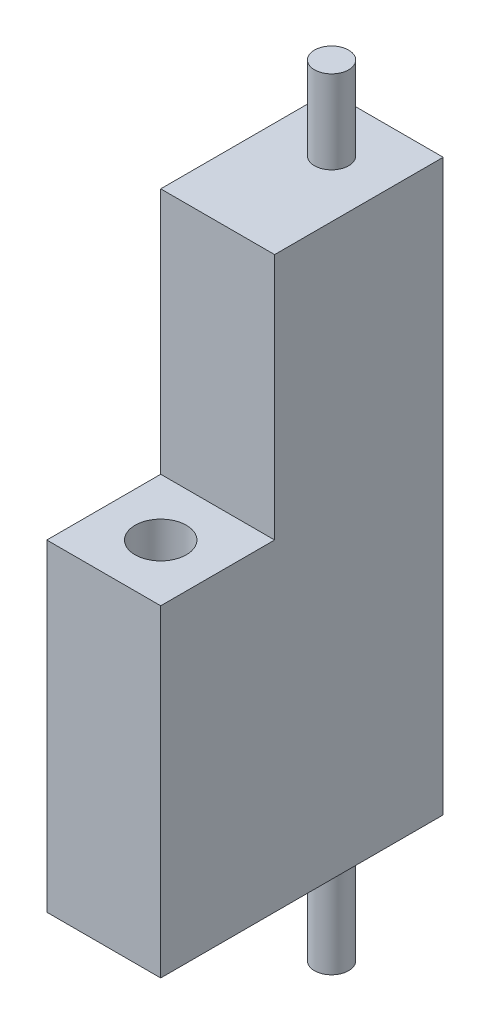
ISO-10303-21;
HEADER;
FILE_DESCRIPTION(('STEP AP214'),'2;1');
FILE_NAME('part.step','',(''),(''),'','','');
FILE_SCHEMA(('AUTOMOTIVE_DESIGN { 1 0 10303 214 1 1 1 1 }'));
ENDSEC;
DATA;
#1=APPLICATION_CONTEXT('core data for automotive mechanical design processes');
#2=APPLICATION_PROTOCOL_DEFINITION('international standard','automotive_design',2000,#1);
#3=PRODUCT_CONTEXT('',#1,'mechanical');
#4=PRODUCT('Part','Part','',(#3));
#5=PRODUCT_RELATED_PRODUCT_CATEGORY('part','',(#4));
#6=PRODUCT_DEFINITION_FORMATION('','',#4);
#7=PRODUCT_DEFINITION_CONTEXT('part definition',#1,'design');
#8=PRODUCT_DEFINITION('design','',#6,#7);
#9=PRODUCT_DEFINITION_SHAPE('','',#8);
#10=(LENGTH_UNIT() NAMED_UNIT(*) SI_UNIT(.MILLI.,.METRE.));
#11=(NAMED_UNIT(*) PLANE_ANGLE_UNIT() SI_UNIT($,.RADIAN.));
#12=(NAMED_UNIT(*) SI_UNIT($,.STERADIAN.) SOLID_ANGLE_UNIT());
#13=UNCERTAINTY_MEASURE_WITH_UNIT(LENGTH_MEASURE(1.E-05),#10,'distance_accuracy_value','');
#14=(GEOMETRIC_REPRESENTATION_CONTEXT(3) GLOBAL_UNCERTAINTY_ASSIGNED_CONTEXT((#13)) GLOBAL_UNIT_ASSIGNED_CONTEXT((#10,
#11,#12)) REPRESENTATION_CONTEXT('',''));
#15=CARTESIAN_POINT('',(0.,0.,0.));
#16=DIRECTION('',(0.,0.,1.));
#17=DIRECTION('',(1.,0.,0.));
#18=AXIS2_PLACEMENT_3D('',#15,#16,#17);
#19=CARTESIAN_POINT('',(0.,-33.,-50.));
#20=DIRECTION('',(0.,-1.,0.));
#21=DIRECTION('',(0.,0.,-1.));
#22=AXIS2_PLACEMENT_3D('',#19,#20,#21);
#23=PLANE('',#22);
#24=CARTESIAN_POINT('',(22.5,-33.,0.));
#25=DIRECTION('',(0.,-1.,0.));
#26=DIRECTION('',(0.,0.,-1.));
#27=AXIS2_PLACEMENT_3D('',#24,#25,#26);
#28=CIRCLE('',#27,20.32);
#29=CARTESIAN_POINT('',(22.5,-33.,-20.32));
#30=VERTEX_POINT('',#29);
#31=EDGE_CURVE('E309',#30,#30,#28,.T.);
#32=ORIENTED_EDGE('',*,*,#31,.F.);
#33=EDGE_LOOP('',(#32));
#34=FACE_BOUND('',#33,.T.);
#35=DIRECTION('',(0.,0.,1.));
#36=VECTOR('',#35,1.);
#37=CARTESIAN_POINT('',(72.5,-33.,-50.));
#38=LINE('',#37,#36);
#39=CARTESIAN_POINT('',(72.5,-33.,-198.));
#40=VERTEX_POINT('',#39);
#41=CARTESIAN_POINT('',(72.5,-33.,49.9999999999999));
#42=VERTEX_POINT('',#41);
#43=EDGE_CURVE('E413',#40,#42,#38,.T.);
#44=ORIENTED_EDGE('',*,*,#43,.T.);
#45=DIRECTION('',(1.,0.,0.));
#46=VECTOR('',#45,1.);
#47=CARTESIAN_POINT('',(0.,-33.,49.9999999999999));
#48=LINE('',#47,#46);
#49=CARTESIAN_POINT('',(-27.5,-33.,49.9999999999999));
#50=VERTEX_POINT('',#49);
#51=EDGE_CURVE('E408',#50,#42,#48,.T.);
#52=ORIENTED_EDGE('',*,*,#51,.F.);
#53=DIRECTION('',(0.,0.,1.));
#54=VECTOR('',#53,1.);
#55=CARTESIAN_POINT('',(-27.5,-33.,-50.));
#56=LINE('',#55,#54);
#57=CARTESIAN_POINT('',(-27.5,-33.,-198.));
#58=VERTEX_POINT('',#57);
#59=EDGE_CURVE('E412',#58,#50,#56,.T.);
#60=ORIENTED_EDGE('',*,*,#59,.F.);
#61=DIRECTION('',(-1.,0.,0.));
#62=VECTOR('',#61,1.);
#63=CARTESIAN_POINT('',(72.5,-33.,-198.));
#64=LINE('',#63,#62);
#65=EDGE_CURVE('E381',#40,#58,#64,.T.);
#66=ORIENTED_EDGE('',*,*,#65,.F.);
#67=EDGE_LOOP('',(#44,#52,#60,#66));
#68=FACE_BOUND('',#67,.T.);
#69=CARTESIAN_POINT('',(22.5,-33.,-150.));
#70=DIRECTION('',(0.,-1.,0.));
#71=DIRECTION('',(0.,0.,-1.));
#72=AXIS2_PLACEMENT_3D('',#69,#70,#71);
#73=CIRCLE('',#72,15.);
#74=CARTESIAN_POINT('',(22.5,-33.,-165.));
#75=VERTEX_POINT('',#74);
#76=EDGE_CURVE('E317',#75,#75,#73,.F.);
#77=ORIENTED_EDGE('',*,*,#76,.T.);
#78=EDGE_LOOP('',(#77));
#79=FACE_BOUND('',#78,.T.);
#80=ADVANCED_FACE('F79',(#34,#68,#79),#23,.T.);
#81=CARTESIAN_POINT('',(0.,10.,0.));
#82=DIRECTION('',(0.,-1.,0.));
#83=DIRECTION('',(0.,0.,-1.));
#84=AXIS2_PLACEMENT_3D('',#81,#82,#83);
#85=PLANE('',#84);
#86=CARTESIAN_POINT('',(22.5,10.,0.));
#87=DIRECTION('',(0.,1.,0.));
#88=DIRECTION('',(0.,0.,1.));
#89=AXIS2_PLACEMENT_3D('',#86,#87,#88);
#90=CIRCLE('',#89,14.);
#91=CARTESIAN_POINT('',(22.5,10.,14.));
#92=VERTEX_POINT('',#91);
#93=EDGE_CURVE('E245',#92,#92,#90,.T.);
#94=ORIENTED_EDGE('',*,*,#93,.F.);
#95=EDGE_LOOP('',(#94));
#96=FACE_BOUND('',#95,.T.);
#97=CARTESIAN_POINT('',(40.0000000000002,10.,1.80411241501588E-13));
#98=DIRECTION('',(0.,-1.,0.));
#99=DIRECTION('',(0.,0.,-1.));
#100=AXIS2_PLACEMENT_3D('',#97,#98,#99);
#101=CIRCLE('',#100,2.);
#102=CARTESIAN_POINT('',(40.0000000000002,10.,-1.99999999999982));
#103=VERTEX_POINT('',#102);
#104=EDGE_CURVE('E278',#103,#103,#101,.T.);
#105=ORIENTED_EDGE('',*,*,#104,.T.);
#106=EDGE_LOOP('',(#105));
#107=FACE_BOUND('',#106,.T.);
#108=CARTESIAN_POINT('',(34.8743686707647,10.,12.3743686707647));
#109=DIRECTION('',(0.,-1.,0.));
#110=DIRECTION('',(0.,0.,-1.));
#111=AXIS2_PLACEMENT_3D('',#108,#109,#110);
#112=CIRCLE('',#111,2.);
#113=CARTESIAN_POINT('',(34.8743686707647,10.,10.3743686707647));
#114=VERTEX_POINT('',#113);
#115=EDGE_CURVE('E286',#114,#114,#112,.T.);
#116=ORIENTED_EDGE('',*,*,#115,.T.);
#117=EDGE_LOOP('',(#116));
#118=FACE_BOUND('',#117,.T.);
#119=CARTESIAN_POINT('',(22.5,10.,17.5));
#120=DIRECTION('',(0.,-1.,0.));
#121=DIRECTION('',(0.,0.,-1.));
#122=AXIS2_PLACEMENT_3D('',#119,#120,#121);
#123=CIRCLE('',#122,2.);
#124=CARTESIAN_POINT('',(22.5,10.,15.5));
#125=VERTEX_POINT('',#124);
#126=EDGE_CURVE('E294',#125,#125,#123,.T.);
#127=ORIENTED_EDGE('',*,*,#126,.T.);
#128=EDGE_LOOP('',(#127));
#129=FACE_BOUND('',#128,.T.);
#130=CARTESIAN_POINT('',(10.1256313292356,10.,12.3743686707646));
#131=DIRECTION('',(0.,-1.,0.));
#132=DIRECTION('',(0.,0.,-1.));
#133=AXIS2_PLACEMENT_3D('',#130,#131,#132);
#134=CIRCLE('',#133,2.);
#135=CARTESIAN_POINT('',(10.1256313292356,10.,10.3743686707646));
#136=VERTEX_POINT('',#135);
#137=EDGE_CURVE('E253',#136,#136,#134,.T.);
#138=ORIENTED_EDGE('',*,*,#137,.T.);
#139=EDGE_LOOP('',(#138));
#140=FACE_BOUND('',#139,.T.);
#141=CARTESIAN_POINT('',(5.00000000000024,10.,0.));
#142=DIRECTION('',(0.,-1.,0.));
#143=DIRECTION('',(0.,0.,-1.));
#144=AXIS2_PLACEMENT_3D('',#141,#142,#143);
#145=CIRCLE('',#144,2.);
#146=CARTESIAN_POINT('',(5.00000000000024,10.,-2.00000000000006));
#147=VERTEX_POINT('',#146);
#148=EDGE_CURVE('E254',#147,#147,#145,.T.);
#149=ORIENTED_EDGE('',*,*,#148,.T.);
#150=EDGE_LOOP('',(#149));
#151=FACE_BOUND('',#150,.T.);
#152=CARTESIAN_POINT('',(10.1256313292357,10.,-12.3743686707646));
#153=DIRECTION('',(0.,-1.,0.));
#154=DIRECTION('',(0.,0.,-1.));
#155=AXIS2_PLACEMENT_3D('',#152,#153,#154);
#156=CIRCLE('',#155,2.);
#157=CARTESIAN_POINT('',(10.1256313292357,10.,-14.3743686707646));
#158=VERTEX_POINT('',#157);
#159=EDGE_CURVE('E262',#158,#158,#156,.T.);
#160=ORIENTED_EDGE('',*,*,#159,.T.);
#161=EDGE_LOOP('',(#160));
#162=FACE_BOUND('',#161,.T.);
#163=CARTESIAN_POINT('',(22.5000000000003,10.,-17.4999999999995));
#164=DIRECTION('',(0.,-1.,0.));
#165=DIRECTION('',(0.,0.,-1.));
#166=AXIS2_PLACEMENT_3D('',#163,#164,#165);
#167=CIRCLE('',#166,2.00000000000007);
#168=CARTESIAN_POINT('',(22.5000000000003,10.,-19.4999999999995));
#169=VERTEX_POINT('',#168);
#170=EDGE_CURVE('E244',#169,#169,#167,.T.);
#171=ORIENTED_EDGE('',*,*,#170,.T.);
#172=EDGE_LOOP('',(#171));
#173=FACE_BOUND('',#172,.T.);
#174=CARTESIAN_POINT('',(34.8743686707646,10.,-12.374368670764));
#175=DIRECTION('',(0.,-1.,0.));
#176=DIRECTION('',(0.,0.,-1.));
#177=AXIS2_PLACEMENT_3D('',#174,#175,#176);
#178=CIRCLE('',#177,2.00000000000026);
#179=CARTESIAN_POINT('',(34.8743686707646,10.,-14.3743686707643));
#180=VERTEX_POINT('',#179);
#181=EDGE_CURVE('E305',#180,#180,#178,.T.);
#182=ORIENTED_EDGE('',*,*,#181,.T.);
#183=EDGE_LOOP('',(#182));
#184=FACE_BOUND('',#183,.T.);
#185=CARTESIAN_POINT('',(22.5,10.,0.));
#186=DIRECTION('',(0.,-1.,0.));
#187=DIRECTION('',(0.,0.,-1.));
#188=AXIS2_PLACEMENT_3D('',#185,#186,#187);
#189=CIRCLE('',#188,21.5);
#190=CARTESIAN_POINT('',(22.5,10.,-21.5));
#191=VERTEX_POINT('',#190);
#192=EDGE_CURVE('E443',#191,#191,#189,.T.);
#193=ORIENTED_EDGE('',*,*,#192,.F.);
#194=EDGE_LOOP('',(#193));
#195=FACE_BOUND('',#194,.T.);
#196=ADVANCED_FACE('F504',(#96,#107,#118,#129,#140,#151,#162,#173,#184,#195),#85,.F.);
#197=CARTESIAN_POINT('',(22.5,0.,0.));
#198=DIRECTION('',(0.,-1.,0.));
#199=DIRECTION('',(0.,0.,-1.));
#200=AXIS2_PLACEMENT_3D('',#197,#198,#199);
#201=CYLINDRICAL_SURFACE('',#200,21.5);
#202=ORIENTED_EDGE('',*,*,#192,.T.);
#203=EDGE_LOOP('',(#202));
#204=FACE_BOUND('',#203,.T.);
#205=CARTESIAN_POINT('',(22.5,102.,0.));
#206=DIRECTION('',(0.,-1.,0.));
#207=DIRECTION('',(0.,0.,-1.));
#208=AXIS2_PLACEMENT_3D('',#205,#206,#207);
#209=CIRCLE('',#208,21.5);
#210=CARTESIAN_POINT('',(22.5,102.,-21.5));
#211=VERTEX_POINT('',#210);
#212=EDGE_CURVE('E447',#211,#211,#209,.T.);
#213=ORIENTED_EDGE('',*,*,#212,.F.);
#214=EDGE_LOOP('',(#213));
#215=FACE_BOUND('',#214,.T.);
#216=ADVANCED_FACE('F510',(#204,#215),#201,.F.);
#217=CARTESIAN_POINT('',(-1.41553435639707E-12,102.,0.));
#218=DIRECTION('',(0.,-1.,0.));
#219=DIRECTION('',(0.,0.,-1.));
#220=AXIS2_PLACEMENT_3D('',#217,#218,#219);
#221=PLANE('',#220);
#222=CARTESIAN_POINT('',(22.5,102.,0.));
#223=DIRECTION('',(0.,-1.,0.));
#224=DIRECTION('',(0.,0.,-1.));
#225=AXIS2_PLACEMENT_3D('',#222,#223,#224);
#226=CIRCLE('',#225,22.5);
#227=CARTESIAN_POINT('',(22.5,102.,-22.5));
#228=VERTEX_POINT('',#227);
#229=EDGE_CURVE('E451',#228,#228,#226,.T.);
#230=ORIENTED_EDGE('',*,*,#229,.F.);
#231=EDGE_LOOP('',(#230));
#232=FACE_BOUND('',#231,.T.);
#233=ORIENTED_EDGE('',*,*,#212,.T.);
#234=EDGE_LOOP('',(#233));
#235=FACE_BOUND('',#234,.T.);
#236=ADVANCED_FACE('F523',(#232,#235),#221,.F.);
#237=CARTESIAN_POINT('',(22.5,0.,0.));
#238=DIRECTION('',(0.,-1.,0.));
#239=DIRECTION('',(0.,0.,-1.));
#240=AXIS2_PLACEMENT_3D('',#237,#238,#239);
#241=CYLINDRICAL_SURFACE('',#240,22.5);
#242=CARTESIAN_POINT('',(22.5,250.,0.));
#243=DIRECTION('',(0.,-1.,0.));
#244=DIRECTION('',(0.,0.,-1.));
#245=AXIS2_PLACEMENT_3D('',#242,#243,#244);
#246=CIRCLE('',#245,22.5);
#247=CARTESIAN_POINT('',(22.5,250.,-22.5));
#248=VERTEX_POINT('',#247);
#249=EDGE_CURVE('E455',#248,#248,#246,.T.);
#250=ORIENTED_EDGE('',*,*,#249,.F.);
#251=EDGE_LOOP('',(#250));
#252=FACE_BOUND('',#251,.T.);
#253=ORIENTED_EDGE('',*,*,#229,.T.);
#254=EDGE_LOOP('',(#253));
#255=FACE_BOUND('',#254,.T.);
#256=ADVANCED_FACE('F526',(#252,#255),#241,.F.);
#257=CARTESIAN_POINT('',(6.93889390390723E-13,250.,0.));
#258=DIRECTION('',(0.,-1.,0.));
#259=DIRECTION('',(0.,0.,-1.));
#260=AXIS2_PLACEMENT_3D('',#257,#258,#259);
#261=PLANE('',#260);
#262=ORIENTED_EDGE('',*,*,#249,.T.);
#263=EDGE_LOOP('',(#262));
#264=FACE_BOUND('',#263,.T.);
#265=DIRECTION('',(0.,0.,1.));
#266=VECTOR('',#265,1.);
#267=CARTESIAN_POINT('',(72.5,250.,0.));
#268=LINE('',#267,#266);
#269=CARTESIAN_POINT('',(72.5,250.,-50.));
#270=VERTEX_POINT('',#269);
#271=CARTESIAN_POINT('',(72.5,250.,50.));
#272=VERTEX_POINT('',#271);
#273=EDGE_CURVE('E436',#270,#272,#268,.T.);
#274=ORIENTED_EDGE('',*,*,#273,.F.);
#275=DIRECTION('',(1.,0.,0.));
#276=VECTOR('',#275,1.);
#277=CARTESIAN_POINT('',(0.,250.,-50.));
#278=LINE('',#277,#276);
#279=CARTESIAN_POINT('',(-27.5,250.,-50.));
#280=VERTEX_POINT('',#279);
#281=EDGE_CURVE('E417',#280,#270,#278,.T.);
#282=ORIENTED_EDGE('',*,*,#281,.F.);
#283=DIRECTION('',(0.,0.,1.));
#284=VECTOR('',#283,1.);
#285=CARTESIAN_POINT('',(-27.5,250.,0.));
#286=LINE('',#285,#284);
#287=CARTESIAN_POINT('',(-27.5,250.,50.));
#288=VERTEX_POINT('',#287);
#289=EDGE_CURVE('E428',#280,#288,#286,.T.);
#290=ORIENTED_EDGE('',*,*,#289,.T.);
#291=DIRECTION('',(1.,0.,0.));
#292=VECTOR('',#291,1.);
#293=CARTESIAN_POINT('',(0.,250.,50.));
#294=LINE('',#293,#292);
#295=EDGE_CURVE('E432',#288,#272,#294,.T.);
#296=ORIENTED_EDGE('',*,*,#295,.T.);
#297=EDGE_LOOP('',(#274,#282,#290,#296));
#298=FACE_BOUND('',#297,.T.);
#299=ADVANCED_FACE('F81',(#264,#298),#261,.F.);
#300=CARTESIAN_POINT('',(72.5,0.,0.));
#301=DIRECTION('',(-1.,0.,0.));
#302=DIRECTION('',(0.,0.,1.));
#303=AXIS2_PLACEMENT_3D('',#300,#301,#302);
#304=PLANE('',#303);
#305=ORIENTED_EDGE('',*,*,#273,.T.);
#306=DIRECTION('',(0.,1.,0.));
#307=VECTOR('',#306,1.);
#308=CARTESIAN_POINT('',(72.5,0.,50.));
#309=LINE('',#308,#307);
#310=EDGE_CURVE('E440',#42,#272,#309,.T.);
#311=ORIENTED_EDGE('',*,*,#310,.F.);
#312=ORIENTED_EDGE('',*,*,#43,.F.);
#313=DIRECTION('',(0.,-1.,0.));
#314=VECTOR('',#313,1.);
#315=CARTESIAN_POINT('',(72.5,467.,-198.));
#316=LINE('',#315,#314);
#317=CARTESIAN_POINT('',(72.5,467.,-198.));
#318=VERTEX_POINT('',#317);
#319=EDGE_CURVE('E377',#318,#40,#316,.T.);
#320=ORIENTED_EDGE('',*,*,#319,.F.);
#321=DIRECTION('',(0.,0.,1.));
#322=VECTOR('',#321,1.);
#323=CARTESIAN_POINT('',(72.5,467.,-198.));
#324=LINE('',#323,#322);
#325=CARTESIAN_POINT('',(72.5,467.,-50.));
#326=VERTEX_POINT('',#325);
#327=EDGE_CURVE('E392',#318,#326,#324,.T.);
#328=ORIENTED_EDGE('',*,*,#327,.T.);
#329=DIRECTION('',(0.,-1.,0.));
#330=VECTOR('',#329,1.);
#331=CARTESIAN_POINT('',(72.5,467.,-50.));
#332=LINE('',#331,#330);
#333=EDGE_CURVE('E376',#326,#270,#332,.T.);
#334=ORIENTED_EDGE('',*,*,#333,.T.);
#335=EDGE_LOOP('',(#305,#311,#312,#320,#328,#334));
#336=FACE_BOUND('',#335,.T.);
#337=ADVANCED_FACE('F480',(#336),#304,.F.);
#338=CARTESIAN_POINT('',(0.,0.,50.));
#339=DIRECTION('',(0.,0.,1.));
#340=DIRECTION('',(1.,0.,0.));
#341=AXIS2_PLACEMENT_3D('',#338,#339,#340);
#342=PLANE('',#341);
#343=ORIENTED_EDGE('',*,*,#295,.F.);
#344=DIRECTION('',(0.,1.,0.));
#345=VECTOR('',#344,1.);
#346=CARTESIAN_POINT('',(-27.5,0.,50.));
#347=LINE('',#346,#345);
#348=EDGE_CURVE('E424',#50,#288,#347,.T.);
#349=ORIENTED_EDGE('',*,*,#348,.F.);
#350=ORIENTED_EDGE('',*,*,#51,.T.);
#351=ORIENTED_EDGE('',*,*,#310,.T.);
#352=EDGE_LOOP('',(#343,#349,#350,#351));
#353=FACE_BOUND('',#352,.T.);
#354=ADVANCED_FACE('F488',(#353),#342,.T.);
#355=CARTESIAN_POINT('',(-27.5,0.,0.));
#356=DIRECTION('',(-1.,0.,0.));
#357=DIRECTION('',(0.,0.,1.));
#358=AXIS2_PLACEMENT_3D('',#355,#356,#357);
#359=PLANE('',#358);
#360=ORIENTED_EDGE('',*,*,#289,.F.);
#361=DIRECTION('',(0.,1.,0.));
#362=VECTOR('',#361,1.);
#363=CARTESIAN_POINT('',(-27.5,467.,-50.));
#364=LINE('',#363,#362);
#365=CARTESIAN_POINT('',(-27.5,467.,-50.));
#366=VERTEX_POINT('',#365);
#367=EDGE_CURVE('E396',#280,#366,#364,.T.);
#368=ORIENTED_EDGE('',*,*,#367,.T.);
#369=DIRECTION('',(0.,0.,1.));
#370=VECTOR('',#369,1.);
#371=CARTESIAN_POINT('',(-27.5,467.,-198.));
#372=LINE('',#371,#370);
#373=CARTESIAN_POINT('',(-27.5,467.,-198.));
#374=VERTEX_POINT('',#373);
#375=EDGE_CURVE('E404',#374,#366,#372,.T.);
#376=ORIENTED_EDGE('',*,*,#375,.F.);
#377=DIRECTION('',(0.,1.,0.));
#378=VECTOR('',#377,1.);
#379=CARTESIAN_POINT('',(-27.5,467.,-198.));
#380=LINE('',#379,#378);
#381=EDGE_CURVE('E386',#58,#374,#380,.T.);
#382=ORIENTED_EDGE('',*,*,#381,.F.);
#383=ORIENTED_EDGE('',*,*,#59,.T.);
#384=ORIENTED_EDGE('',*,*,#348,.T.);
#385=EDGE_LOOP('',(#360,#368,#376,#382,#383,#384));
#386=FACE_BOUND('',#385,.T.);
#387=ADVANCED_FACE('F491',(#386),#359,.T.);
#388=CARTESIAN_POINT('',(0.,0.,-50.));
#389=DIRECTION('',(0.,0.,-1.));
#390=DIRECTION('',(-1.,0.,0.));
#391=AXIS2_PLACEMENT_3D('',#388,#389,#390);
#392=PLANE('',#391);
#393=ORIENTED_EDGE('',*,*,#367,.F.);
#394=ORIENTED_EDGE('',*,*,#281,.T.);
#395=ORIENTED_EDGE('',*,*,#333,.F.);
#396=DIRECTION('',(1.,0.,0.));
#397=VECTOR('',#396,1.);
#398=CARTESIAN_POINT('',(72.5,467.,-50.));
#399=LINE('',#398,#397);
#400=EDGE_CURVE('E382',#366,#326,#399,.T.);
#401=ORIENTED_EDGE('',*,*,#400,.F.);
#402=EDGE_LOOP('',(#393,#394,#395,#401));
#403=FACE_BOUND('',#402,.T.);
#404=ADVANCED_FACE('F469',(#403),#392,.F.);
#405=CARTESIAN_POINT('',(72.5,467.,-198.));
#406=DIRECTION('',(0.,-1.,0.));
#407=DIRECTION('',(0.,0.,-1.));
#408=AXIS2_PLACEMENT_3D('',#405,#406,#407);
#409=PLANE('',#408);
#410=CARTESIAN_POINT('',(22.5,467.,-150.));
#411=DIRECTION('',(0.,-1.,0.));
#412=DIRECTION('',(0.,0.,-1.));
#413=AXIS2_PLACEMENT_3D('',#410,#411,#412);
#414=CIRCLE('',#413,15.);
#415=CARTESIAN_POINT('',(22.5,467.,-165.));
#416=VERTEX_POINT('',#415);
#417=EDGE_CURVE('E90',#416,#416,#414,.F.);
#418=ORIENTED_EDGE('',*,*,#417,.F.);
#419=EDGE_LOOP('',(#418));
#420=FACE_BOUND('',#419,.T.);
#421=ORIENTED_EDGE('',*,*,#400,.T.);
#422=ORIENTED_EDGE('',*,*,#327,.F.);
#423=DIRECTION('',(1.,0.,0.));
#424=VECTOR('',#423,1.);
#425=CARTESIAN_POINT('',(72.5,467.,-198.));
#426=LINE('',#425,#424);
#427=EDGE_CURVE('E389',#374,#318,#426,.T.);
#428=ORIENTED_EDGE('',*,*,#427,.F.);
#429=ORIENTED_EDGE('',*,*,#375,.T.);
#430=EDGE_LOOP('',(#421,#422,#428,#429));
#431=FACE_BOUND('',#430,.T.);
#432=ADVANCED_FACE('F465',(#420,#431),#409,.F.);
#433=CARTESIAN_POINT('',(0.,0.,-198.));
#434=DIRECTION('',(0.,0.,-1.));
#435=DIRECTION('',(-1.,0.,0.));
#436=AXIS2_PLACEMENT_3D('',#433,#434,#435);
#437=PLANE('',#436);
#438=ORIENTED_EDGE('',*,*,#319,.T.);
#439=ORIENTED_EDGE('',*,*,#65,.T.);
#440=ORIENTED_EDGE('',*,*,#381,.T.);
#441=ORIENTED_EDGE('',*,*,#427,.T.);
#442=EDGE_LOOP('',(#438,#439,#440,#441));
#443=FACE_BOUND('',#442,.T.);
#444=ADVANCED_FACE('F468',(#443),#437,.T.);
#445=CARTESIAN_POINT('',(0.,540.,0.));
#446=DIRECTION('',(0.,1.,0.));
#447=DIRECTION('',(0.,0.,1.));
#448=AXIS2_PLACEMENT_3D('',#445,#446,#447);
#449=PLANE('',#448);
#450=CARTESIAN_POINT('',(22.5,540.,-150.));
#451=DIRECTION('',(0.,1.,0.));
#452=DIRECTION('',(0.,0.,1.));
#453=AXIS2_PLACEMENT_3D('',#450,#451,#452);
#454=CIRCLE('',#453,15.);
#455=CARTESIAN_POINT('',(22.5,540.,-135.));
#456=VERTEX_POINT('',#455);
#457=EDGE_CURVE('E372',#456,#456,#454,.T.);
#458=ORIENTED_EDGE('',*,*,#457,.T.);
#459=EDGE_LOOP('',(#458));
#460=FACE_BOUND('',#459,.T.);
#461=ADVANCED_FACE('F494',(#460),#449,.T.);
#462=CARTESIAN_POINT('',(22.5,540.,-150.));
#463=DIRECTION('',(0.,-1.,0.));
#464=DIRECTION('',(0.,0.,-1.));
#465=AXIS2_PLACEMENT_3D('',#462,#463,#464);
#466=CYLINDRICAL_SURFACE('',#465,15.);
#467=ORIENTED_EDGE('',*,*,#457,.F.);
#468=EDGE_LOOP('',(#467));
#469=FACE_BOUND('',#468,.T.);
#470=ORIENTED_EDGE('',*,*,#417,.T.);
#471=EDGE_LOOP('',(#470));
#472=FACE_BOUND('',#471,.T.);
#473=ADVANCED_FACE('F463',(#469,#472),#466,.T.);
#474=CARTESIAN_POINT('',(0.,-145.,0.));
#475=DIRECTION('',(0.,1.,0.));
#476=DIRECTION('',(0.,0.,1.));
#477=AXIS2_PLACEMENT_3D('',#474,#475,#476);
#478=PLANE('',#477);
#479=CARTESIAN_POINT('',(22.5,-145.,-150.));
#480=DIRECTION('',(0.,1.,0.));
#481=DIRECTION('',(0.,0.,1.));
#482=AXIS2_PLACEMENT_3D('',#479,#480,#481);
#483=CIRCLE('',#482,15.);
#484=CARTESIAN_POINT('',(22.5,-145.,-135.));
#485=VERTEX_POINT('',#484);
#486=EDGE_CURVE('E359',#485,#485,#483,.T.);
#487=ORIENTED_EDGE('',*,*,#486,.F.);
#488=EDGE_LOOP('',(#487));
#489=FACE_BOUND('',#488,.T.);
#490=ADVANCED_FACE('F586',(#489),#478,.F.);
#491=ORIENTED_EDGE('',*,*,#76,.F.);
#492=EDGE_LOOP('',(#491));
#493=FACE_BOUND('',#492,.T.);
#494=ORIENTED_EDGE('',*,*,#486,.T.);
#495=EDGE_LOOP('',(#494));
#496=FACE_BOUND('',#495,.T.);
#497=ADVANCED_FACE('F588',(#493,#496),#466,.T.);
#498=CARTESIAN_POINT('',(22.5,0.,0.));
#499=DIRECTION('',(0.,-1.,0.));
#500=DIRECTION('',(0.,0.,-1.));
#501=AXIS2_PLACEMENT_3D('',#498,#499,#500);
#502=CYLINDRICAL_SURFACE('',#501,20.32);
#503=CARTESIAN_POINT('',(22.5,0.,0.));
#504=DIRECTION('',(0.,-1.,0.));
#505=DIRECTION('',(0.,0.,-1.));
#506=AXIS2_PLACEMENT_3D('',#503,#504,#505);
#507=CIRCLE('',#506,20.32);
#508=CARTESIAN_POINT('',(22.5,0.,-20.32));
#509=VERTEX_POINT('',#508);
#510=EDGE_CURVE('E313',#509,#509,#507,.T.);
#511=ORIENTED_EDGE('',*,*,#510,.F.);
#512=EDGE_LOOP('',(#511));
#513=FACE_BOUND('',#512,.T.);
#514=ORIENTED_EDGE('',*,*,#31,.T.);
#515=EDGE_LOOP('',(#514));
#516=FACE_BOUND('',#515,.T.);
#517=ADVANCED_FACE('F624',(#513,#516),#502,.F.);
#518=CARTESIAN_POINT('',(22.5,0.,0.));
#519=DIRECTION('',(0.,-1.,0.));
#520=DIRECTION('',(0.,0.,-1.));
#521=AXIS2_PLACEMENT_3D('',#518,#519,#520);
#522=PLANE('',#521);
#523=DIRECTION('',(0.,0.,1.));
#524=VECTOR('',#523,1.);
#525=CARTESIAN_POINT('',(24.5,0.,0.));
#526=LINE('',#525,#524);
#527=CARTESIAN_POINT('',(24.5,0.,-8.));
#528=VERTEX_POINT('',#527);
#529=CARTESIAN_POINT('',(24.5,0.,-5.65685424949238));
#530=VERTEX_POINT('',#529);
#531=EDGE_CURVE('E210',#528,#530,#526,.T.);
#532=ORIENTED_EDGE('',*,*,#531,.F.);
#533=DIRECTION('',(1.,0.,0.));
#534=VECTOR('',#533,1.);
#535=CARTESIAN_POINT('',(0.,0.,-8.));
#536=LINE('',#535,#534);
#537=CARTESIAN_POINT('',(20.5,0.,-8.));
#538=VERTEX_POINT('',#537);
#539=EDGE_CURVE('E213',#538,#528,#536,.T.);
#540=ORIENTED_EDGE('',*,*,#539,.F.);
#541=DIRECTION('',(0.,0.,1.));
#542=VECTOR('',#541,1.);
#543=CARTESIAN_POINT('',(20.5,0.,0.));
#544=LINE('',#543,#542);
#545=CARTESIAN_POINT('',(20.5,0.,-5.65685424949238));
#546=VERTEX_POINT('',#545);
#547=EDGE_CURVE('E187',#538,#546,#544,.T.);
#548=ORIENTED_EDGE('',*,*,#547,.T.);
#549=CARTESIAN_POINT('',(22.5,0.,0.));
#550=DIRECTION('',(0.,-1.,0.));
#551=DIRECTION('',(0.,0.,-1.));
#552=AXIS2_PLACEMENT_3D('',#549,#550,#551);
#553=CIRCLE('',#552,6.);
#554=EDGE_CURVE('E226',#530,#546,#553,.T.);
#555=ORIENTED_EDGE('',*,*,#554,.F.);
#556=EDGE_LOOP('',(#532,#540,#548,#555));
#557=FACE_BOUND('',#556,.T.);
#558=CARTESIAN_POINT('',(40.0000000000002,0.,1.80411241501588E-13));
#559=DIRECTION('',(0.,-1.,0.));
#560=DIRECTION('',(0.,0.,-1.));
#561=AXIS2_PLACEMENT_3D('',#558,#559,#560);
#562=CIRCLE('',#561,2.);
#563=CARTESIAN_POINT('',(40.0000000000002,0.,-1.99999999999982));
#564=VERTEX_POINT('',#563);
#565=EDGE_CURVE('E273',#564,#564,#562,.T.);
#566=ORIENTED_EDGE('',*,*,#565,.F.);
#567=EDGE_LOOP('',(#566));
#568=FACE_BOUND('',#567,.T.);
#569=CARTESIAN_POINT('',(34.8743686707647,0.,12.3743686707647));
#570=DIRECTION('',(0.,-1.,0.));
#571=DIRECTION('',(0.,0.,-1.));
#572=AXIS2_PLACEMENT_3D('',#569,#570,#571);
#573=CIRCLE('',#572,2.);
#574=CARTESIAN_POINT('',(34.8743686707647,0.,10.3743686707647));
#575=VERTEX_POINT('',#574);
#576=EDGE_CURVE('E282',#575,#575,#573,.T.);
#577=ORIENTED_EDGE('',*,*,#576,.F.);
#578=EDGE_LOOP('',(#577));
#579=FACE_BOUND('',#578,.T.);
#580=CARTESIAN_POINT('',(22.5,0.,17.5));
#581=DIRECTION('',(0.,-1.,0.));
#582=DIRECTION('',(0.,0.,-1.));
#583=AXIS2_PLACEMENT_3D('',#580,#581,#582);
#584=CIRCLE('',#583,2.);
#585=CARTESIAN_POINT('',(22.5,0.,15.5));
#586=VERTEX_POINT('',#585);
#587=EDGE_CURVE('E290',#586,#586,#584,.T.);
#588=ORIENTED_EDGE('',*,*,#587,.F.);
#589=EDGE_LOOP('',(#588));
#590=FACE_BOUND('',#589,.T.);
#591=CARTESIAN_POINT('',(10.1256313292356,0.,12.3743686707646));
#592=DIRECTION('',(0.,-1.,0.));
#593=DIRECTION('',(0.,0.,-1.));
#594=AXIS2_PLACEMENT_3D('',#591,#592,#593);
#595=CIRCLE('',#594,2.);
#596=CARTESIAN_POINT('',(10.1256313292356,0.,10.3743686707646));
#597=VERTEX_POINT('',#596);
#598=EDGE_CURVE('E298',#597,#597,#595,.T.);
#599=ORIENTED_EDGE('',*,*,#598,.F.);
#600=EDGE_LOOP('',(#599));
#601=FACE_BOUND('',#600,.T.);
#602=CARTESIAN_POINT('',(5.00000000000024,0.,0.));
#603=DIRECTION('',(0.,-1.,0.));
#604=DIRECTION('',(0.,0.,-1.));
#605=AXIS2_PLACEMENT_3D('',#602,#603,#604);
#606=CIRCLE('',#605,2.);
#607=CARTESIAN_POINT('',(5.00000000000024,0.,-2.00000000000006));
#608=VERTEX_POINT('',#607);
#609=EDGE_CURVE('E249',#608,#608,#606,.T.);
#610=ORIENTED_EDGE('',*,*,#609,.F.);
#611=EDGE_LOOP('',(#610));
#612=FACE_BOUND('',#611,.T.);
#613=CARTESIAN_POINT('',(10.1256313292357,0.,-12.3743686707646));
#614=DIRECTION('',(0.,-1.,0.));
#615=DIRECTION('',(0.,0.,-1.));
#616=AXIS2_PLACEMENT_3D('',#613,#614,#615);
#617=CIRCLE('',#616,2.);
#618=CARTESIAN_POINT('',(10.1256313292357,0.,-14.3743686707646));
#619=VERTEX_POINT('',#618);
#620=EDGE_CURVE('E258',#619,#619,#617,.T.);
#621=ORIENTED_EDGE('',*,*,#620,.F.);
#622=EDGE_LOOP('',(#621));
#623=FACE_BOUND('',#622,.T.);
#624=CARTESIAN_POINT('',(22.5000000000003,0.,-17.4999999999995));
#625=DIRECTION('',(0.,-1.,0.));
#626=DIRECTION('',(0.,0.,-1.));
#627=AXIS2_PLACEMENT_3D('',#624,#625,#626);
#628=CIRCLE('',#627,2.00000000000007);
#629=CARTESIAN_POINT('',(22.5000000000003,0.,-19.4999999999995));
#630=VERTEX_POINT('',#629);
#631=EDGE_CURVE('E266',#630,#630,#628,.T.);
#632=ORIENTED_EDGE('',*,*,#631,.F.);
#633=EDGE_LOOP('',(#632));
#634=FACE_BOUND('',#633,.T.);
#635=CARTESIAN_POINT('',(34.8743686707646,0.,-12.374368670764));
#636=DIRECTION('',(0.,-1.,0.));
#637=DIRECTION('',(0.,0.,-1.));
#638=AXIS2_PLACEMENT_3D('',#635,#636,#637);
#639=CIRCLE('',#638,2.00000000000026);
#640=CARTESIAN_POINT('',(34.8743686707646,0.,-14.3743686707643));
#641=VERTEX_POINT('',#640);
#642=EDGE_CURVE('E277',#641,#641,#639,.T.);
#643=ORIENTED_EDGE('',*,*,#642,.F.);
#644=EDGE_LOOP('',(#643));
#645=FACE_BOUND('',#644,.T.);
#646=ORIENTED_EDGE('',*,*,#510,.T.);
#647=EDGE_LOOP('',(#646));
#648=FACE_BOUND('',#647,.T.);
#649=ADVANCED_FACE('F694',(#557,#568,#579,#590,#601,#612,#623,#634,#645,#648),#522,.T.);
#650=CARTESIAN_POINT('',(34.8743686707646,10.,-12.374368670764));
#651=DIRECTION('',(0.,-1.,0.));
#652=DIRECTION('',(0.,0.,-1.));
#653=AXIS2_PLACEMENT_3D('',#650,#651,#652);
#654=CYLINDRICAL_SURFACE('',#653,2.00000000000026);
#655=ORIENTED_EDGE('',*,*,#181,.F.);
#656=EDGE_LOOP('',(#655));
#657=FACE_BOUND('',#656,.T.);
#658=ORIENTED_EDGE('',*,*,#642,.T.);
#659=EDGE_LOOP('',(#658));
#660=FACE_BOUND('',#659,.T.);
#661=ADVANCED_FACE('F703',(#657,#660),#654,.F.);
#662=CARTESIAN_POINT('',(22.5000000000003,10.,-17.4999999999995));
#663=DIRECTION('',(0.,-1.,0.));
#664=DIRECTION('',(0.,0.,-1.));
#665=AXIS2_PLACEMENT_3D('',#662,#663,#664);
#666=CYLINDRICAL_SURFACE('',#665,2.00000000000007);
#667=ORIENTED_EDGE('',*,*,#170,.F.);
#668=EDGE_LOOP('',(#667));
#669=FACE_BOUND('',#668,.T.);
#670=ORIENTED_EDGE('',*,*,#631,.T.);
#671=EDGE_LOOP('',(#670));
#672=FACE_BOUND('',#671,.T.);
#673=ADVANCED_FACE('F708',(#669,#672),#666,.F.);
#674=CARTESIAN_POINT('',(10.1256313292357,10.,-12.3743686707646));
#675=DIRECTION('',(0.,-1.,0.));
#676=DIRECTION('',(0.,0.,-1.));
#677=AXIS2_PLACEMENT_3D('',#674,#675,#676);
#678=CYLINDRICAL_SURFACE('',#677,2.);
#679=ORIENTED_EDGE('',*,*,#159,.F.);
#680=EDGE_LOOP('',(#679));
#681=FACE_BOUND('',#680,.T.);
#682=ORIENTED_EDGE('',*,*,#620,.T.);
#683=EDGE_LOOP('',(#682));
#684=FACE_BOUND('',#683,.T.);
#685=ADVANCED_FACE('F718',(#681,#684),#678,.F.);
#686=CARTESIAN_POINT('',(5.00000000000024,10.,0.));
#687=DIRECTION('',(0.,-1.,0.));
#688=DIRECTION('',(0.,0.,-1.));
#689=AXIS2_PLACEMENT_3D('',#686,#687,#688);
#690=CYLINDRICAL_SURFACE('',#689,2.);
#691=ORIENTED_EDGE('',*,*,#148,.F.);
#692=EDGE_LOOP('',(#691));
#693=FACE_BOUND('',#692,.T.);
#694=ORIENTED_EDGE('',*,*,#609,.T.);
#695=EDGE_LOOP('',(#694));
#696=FACE_BOUND('',#695,.T.);
#697=ADVANCED_FACE('F728',(#693,#696),#690,.F.);
#698=CARTESIAN_POINT('',(10.1256313292356,10.,12.3743686707646));
#699=DIRECTION('',(0.,-1.,0.));
#700=DIRECTION('',(0.,0.,-1.));
#701=AXIS2_PLACEMENT_3D('',#698,#699,#700);
#702=CYLINDRICAL_SURFACE('',#701,2.);
#703=ORIENTED_EDGE('',*,*,#137,.F.);
#704=EDGE_LOOP('',(#703));
#705=FACE_BOUND('',#704,.T.);
#706=ORIENTED_EDGE('',*,*,#598,.T.);
#707=EDGE_LOOP('',(#706));
#708=FACE_BOUND('',#707,.T.);
#709=ADVANCED_FACE('F738',(#705,#708),#702,.F.);
#710=CARTESIAN_POINT('',(22.5,10.,17.5));
#711=DIRECTION('',(0.,-1.,0.));
#712=DIRECTION('',(0.,0.,-1.));
#713=AXIS2_PLACEMENT_3D('',#710,#711,#712);
#714=CYLINDRICAL_SURFACE('',#713,2.);
#715=ORIENTED_EDGE('',*,*,#126,.F.);
#716=EDGE_LOOP('',(#715));
#717=FACE_BOUND('',#716,.T.);
#718=ORIENTED_EDGE('',*,*,#587,.T.);
#719=EDGE_LOOP('',(#718));
#720=FACE_BOUND('',#719,.T.);
#721=ADVANCED_FACE('F748',(#717,#720),#714,.F.);
#722=CARTESIAN_POINT('',(34.8743686707647,10.,12.3743686707647));
#723=DIRECTION('',(0.,-1.,0.));
#724=DIRECTION('',(0.,0.,-1.));
#725=AXIS2_PLACEMENT_3D('',#722,#723,#724);
#726=CYLINDRICAL_SURFACE('',#725,2.);
#727=ORIENTED_EDGE('',*,*,#115,.F.);
#728=EDGE_LOOP('',(#727));
#729=FACE_BOUND('',#728,.T.);
#730=ORIENTED_EDGE('',*,*,#576,.T.);
#731=EDGE_LOOP('',(#730));
#732=FACE_BOUND('',#731,.T.);
#733=ADVANCED_FACE('F758',(#729,#732),#726,.F.);
#734=CARTESIAN_POINT('',(40.0000000000002,10.,1.80411241501588E-13));
#735=DIRECTION('',(0.,-1.,0.));
#736=DIRECTION('',(0.,0.,-1.));
#737=AXIS2_PLACEMENT_3D('',#734,#735,#736);
#738=CYLINDRICAL_SURFACE('',#737,2.);
#739=ORIENTED_EDGE('',*,*,#104,.F.);
#740=EDGE_LOOP('',(#739));
#741=FACE_BOUND('',#740,.T.);
#742=ORIENTED_EDGE('',*,*,#565,.T.);
#743=EDGE_LOOP('',(#742));
#744=FACE_BOUND('',#743,.T.);
#745=ADVANCED_FACE('F768',(#741,#744),#738,.F.);
#746=CARTESIAN_POINT('',(22.5,7.,0.));
#747=DIRECTION('',(0.,1.,0.));
#748=DIRECTION('',(0.,0.,1.));
#749=AXIS2_PLACEMENT_3D('',#746,#747,#748);
#750=CYLINDRICAL_SURFACE('',#749,14.);
#751=CARTESIAN_POINT('',(22.5,7.,0.));
#752=DIRECTION('',(0.,1.,0.));
#753=DIRECTION('',(0.,0.,1.));
#754=AXIS2_PLACEMENT_3D('',#751,#752,#753);
#755=CIRCLE('',#754,14.);
#756=CARTESIAN_POINT('',(22.5,7.,14.));
#757=VERTEX_POINT('',#756);
#758=EDGE_CURVE('E240',#757,#757,#755,.T.);
#759=ORIENTED_EDGE('',*,*,#758,.F.);
#760=EDGE_LOOP('',(#759));
#761=FACE_BOUND('',#760,.T.);
#762=ORIENTED_EDGE('',*,*,#93,.T.);
#763=EDGE_LOOP('',(#762));
#764=FACE_BOUND('',#763,.T.);
#765=ADVANCED_FACE('F778',(#761,#764),#750,.F.);
#766=CARTESIAN_POINT('',(22.5,7.,0.));
#767=DIRECTION('',(0.,1.,0.));
#768=DIRECTION('',(0.,0.,1.));
#769=AXIS2_PLACEMENT_3D('',#766,#767,#768);
#770=PLANE('',#769);
#771=CARTESIAN_POINT('',(22.5,7.,0.));
#772=DIRECTION('',(0.,1.,0.));
#773=DIRECTION('',(0.,0.,1.));
#774=AXIS2_PLACEMENT_3D('',#771,#772,#773);
#775=CIRCLE('',#774,8.75);
#776=CARTESIAN_POINT('',(22.5,7.,8.75));
#777=VERTEX_POINT('',#776);
#778=EDGE_CURVE('E83',#777,#777,#775,.T.);
#779=ORIENTED_EDGE('',*,*,#778,.F.);
#780=EDGE_LOOP('',(#779));
#781=FACE_BOUND('',#780,.T.);
#782=ORIENTED_EDGE('',*,*,#758,.T.);
#783=EDGE_LOOP('',(#782));
#784=FACE_BOUND('',#783,.T.);
#785=ADVANCED_FACE('F793',(#781,#784),#770,.T.);
#786=CARTESIAN_POINT('',(22.5,6.,0.));
#787=DIRECTION('',(0.,1.,0.));
#788=DIRECTION('',(0.,0.,1.));
#789=AXIS2_PLACEMENT_3D('',#786,#787,#788);
#790=CYLINDRICAL_SURFACE('',#789,8.75);
#791=ORIENTED_EDGE('',*,*,#778,.T.);
#792=EDGE_LOOP('',(#791));
#793=FACE_BOUND('',#792,.T.);
#794=CARTESIAN_POINT('',(22.5,6.,0.));
#795=DIRECTION('',(0.,1.,0.));
#796=DIRECTION('',(0.,0.,1.));
#797=AXIS2_PLACEMENT_3D('',#794,#795,#796);
#798=CIRCLE('',#797,8.75);
#799=CARTESIAN_POINT('',(22.5,6.,8.75));
#800=VERTEX_POINT('',#799);
#801=EDGE_CURVE('E233',#800,#800,#798,.T.);
#802=ORIENTED_EDGE('',*,*,#801,.F.);
#803=EDGE_LOOP('',(#802));
#804=FACE_BOUND('',#803,.T.);
#805=ADVANCED_FACE('F803',(#793,#804),#790,.F.);
#806=CARTESIAN_POINT('',(22.5,6.,0.));
#807=DIRECTION('',(0.,1.,0.));
#808=DIRECTION('',(0.,0.,1.));
#809=AXIS2_PLACEMENT_3D('',#806,#807,#808);
#810=PLANE('',#809);
#811=DIRECTION('',(0.,0.,1.));
#812=VECTOR('',#811,1.);
#813=CARTESIAN_POINT('',(24.5,6.,0.));
#814=LINE('',#813,#812);
#815=CARTESIAN_POINT('',(24.5,6.,-8.));
#816=VERTEX_POINT('',#815);
#817=CARTESIAN_POINT('',(24.5,6.,-5.65685424949238));
#818=VERTEX_POINT('',#817);
#819=EDGE_CURVE('E202',#816,#818,#814,.T.);
#820=ORIENTED_EDGE('',*,*,#819,.T.);
#821=CARTESIAN_POINT('',(22.5,6.,0.));
#822=DIRECTION('',(0.,-1.,0.));
#823=DIRECTION('',(0.,0.,-1.));
#824=AXIS2_PLACEMENT_3D('',#821,#822,#823);
#825=CIRCLE('',#824,6.);
#826=CARTESIAN_POINT('',(20.5,6.,-5.65685424949238));
#827=VERTEX_POINT('',#826);
#828=EDGE_CURVE('E208',#818,#827,#825,.T.);
#829=ORIENTED_EDGE('',*,*,#828,.T.);
#830=DIRECTION('',(0.,0.,1.));
#831=VECTOR('',#830,1.);
#832=CARTESIAN_POINT('',(20.5,6.,0.));
#833=LINE('',#832,#831);
#834=CARTESIAN_POINT('',(20.5,6.,-8.));
#835=VERTEX_POINT('',#834);
#836=EDGE_CURVE('E97',#835,#827,#833,.T.);
#837=ORIENTED_EDGE('',*,*,#836,.F.);
#838=DIRECTION('',(1.,0.,0.));
#839=VECTOR('',#838,1.);
#840=CARTESIAN_POINT('',(0.,6.,-8.));
#841=LINE('',#840,#839);
#842=EDGE_CURVE('E196',#835,#816,#841,.T.);
#843=ORIENTED_EDGE('',*,*,#842,.T.);
#844=EDGE_LOOP('',(#820,#829,#837,#843));
#845=FACE_BOUND('',#844,.T.);
#846=ORIENTED_EDGE('',*,*,#801,.T.);
#847=EDGE_LOOP('',(#846));
#848=FACE_BOUND('',#847,.T.);
#849=ADVANCED_FACE('F205',(#845,#848),#810,.T.);
#850=CARTESIAN_POINT('',(22.5,6.,0.));
#851=DIRECTION('',(0.,-1.,0.));
#852=DIRECTION('',(0.,0.,-1.));
#853=AXIS2_PLACEMENT_3D('',#850,#851,#852);
#854=CYLINDRICAL_SURFACE('',#853,6.);
#855=ORIENTED_EDGE('',*,*,#828,.F.);
#856=DIRECTION('',(0.,-1.,0.));
#857=VECTOR('',#856,1.);
#858=CARTESIAN_POINT('',(24.5,6.,-5.65685424949238));
#859=LINE('',#858,#857);
#860=EDGE_CURVE('E222',#818,#530,#859,.T.);
#861=ORIENTED_EDGE('',*,*,#860,.T.);
#862=ORIENTED_EDGE('',*,*,#554,.T.);
#863=DIRECTION('',(0.,-1.,0.));
#864=VECTOR('',#863,1.);
#865=CARTESIAN_POINT('',(20.5,6.,-5.65685424949238));
#866=LINE('',#865,#864);
#867=EDGE_CURVE('E193',#827,#546,#866,.T.);
#868=ORIENTED_EDGE('',*,*,#867,.F.);
#869=EDGE_LOOP('',(#855,#861,#862,#868));
#870=FACE_BOUND('',#869,.T.);
#871=ADVANCED_FACE('F829',(#870),#854,.F.);
#872=CARTESIAN_POINT('',(24.5,6.,0.));
#873=DIRECTION('',(1.,0.,0.));
#874=DIRECTION('',(0.,0.,-1.));
#875=AXIS2_PLACEMENT_3D('',#872,#873,#874);
#876=PLANE('',#875);
#877=ORIENTED_EDGE('',*,*,#531,.T.);
#878=ORIENTED_EDGE('',*,*,#860,.F.);
#879=ORIENTED_EDGE('',*,*,#819,.F.);
#880=DIRECTION('',(0.,-1.,0.));
#881=VECTOR('',#880,1.);
#882=CARTESIAN_POINT('',(24.5,6.,-8.));
#883=LINE('',#882,#881);
#884=EDGE_CURVE('E192',#816,#528,#883,.T.);
#885=ORIENTED_EDGE('',*,*,#884,.T.);
#886=EDGE_LOOP('',(#877,#878,#879,#885));
#887=FACE_BOUND('',#886,.T.);
#888=ADVANCED_FACE('F838',(#887),#876,.F.);
#889=CARTESIAN_POINT('',(0.,6.,-8.));
#890=DIRECTION('',(0.,0.,-1.));
#891=DIRECTION('',(-1.,0.,0.));
#892=AXIS2_PLACEMENT_3D('',#889,#890,#891);
#893=PLANE('',#892);
#894=ORIENTED_EDGE('',*,*,#539,.T.);
#895=ORIENTED_EDGE('',*,*,#884,.F.);
#896=ORIENTED_EDGE('',*,*,#842,.F.);
#897=DIRECTION('',(0.,-1.,0.));
#898=VECTOR('',#897,1.);
#899=CARTESIAN_POINT('',(20.5,6.,-8.));
#900=LINE('',#899,#898);
#901=EDGE_CURVE('E183',#835,#538,#900,.T.);
#902=ORIENTED_EDGE('',*,*,#901,.T.);
#903=EDGE_LOOP('',(#894,#895,#896,#902));
#904=FACE_BOUND('',#903,.T.);
#905=ADVANCED_FACE('F197',(#904),#893,.F.);
#906=CARTESIAN_POINT('',(20.5,6.,0.));
#907=DIRECTION('',(1.,0.,0.));
#908=DIRECTION('',(0.,0.,-1.));
#909=AXIS2_PLACEMENT_3D('',#906,#907,#908);
#910=PLANE('',#909);
#911=ORIENTED_EDGE('',*,*,#547,.F.);
#912=ORIENTED_EDGE('',*,*,#901,.F.);
#913=ORIENTED_EDGE('',*,*,#836,.T.);
#914=ORIENTED_EDGE('',*,*,#867,.T.);
#915=EDGE_LOOP('',(#911,#912,#913,#914));
#916=FACE_BOUND('',#915,.T.);
#917=ADVANCED_FACE('F185',(#916),#910,.T.);
#918=CLOSED_SHELL('',(#80,#196,#216,#236,#256,#299,#337,#354,#387,#404,#432,#444,#461,#473,#490,
#497,#517,#649,#661,#673,#685,#697,#709,#721,#733,#745,#765,#785,#805,#849,#871,#888,#905,#917));
#919=CARTESIAN_POINT('',(0.,-23.,0.));
#920=DIRECTION('',(0.,-1.,0.));
#921=DIRECTION('',(0.,0.,-1.));
#922=AXIS2_PLACEMENT_3D('',#919,#920,#921);
#923=PLANE('',#922);
#924=DIRECTION('',(1.,0.,0.));
#925=VECTOR('',#924,1.);
#926=CARTESIAN_POINT('',(0.,-23.,-60.));
#927=LINE('',#926,#925);
#928=CARTESIAN_POINT('',(-17.5,-23.,-60.));
#929=VERTEX_POINT('',#928);
#930=CARTESIAN_POINT('',(62.5,-22.9999999999999,-60.));
#931=VERTEX_POINT('',#930);
#932=EDGE_CURVE('E321',#929,#931,#927,.T.);
#933=ORIENTED_EDGE('',*,*,#932,.T.);
#934=DIRECTION('',(0.,0.,-1.));
#935=VECTOR('',#934,1.);
#936=CARTESIAN_POINT('',(62.5,-23.,0.));
#937=LINE('',#936,#935);
#938=CARTESIAN_POINT('',(62.5,-22.9999999999999,-188.));
#939=VERTEX_POINT('',#938);
#940=EDGE_CURVE('E105',#931,#939,#937,.T.);
#941=ORIENTED_EDGE('',*,*,#940,.T.);
#942=DIRECTION('',(1.,0.,0.));
#943=VECTOR('',#942,1.);
#944=CARTESIAN_POINT('',(0.,-23.,-188.));
#945=LINE('',#944,#943);
#946=CARTESIAN_POINT('',(-17.5,-22.9999999999999,-188.));
#947=VERTEX_POINT('',#946);
#948=EDGE_CURVE('E328',#947,#939,#945,.T.);
#949=ORIENTED_EDGE('',*,*,#948,.F.);
#950=DIRECTION('',(0.,0.,-1.));
#951=VECTOR('',#950,1.);
#952=CARTESIAN_POINT('',(-17.5,-23.,0.));
#953=LINE('',#952,#951);
#954=EDGE_CURVE('E325',#929,#947,#953,.T.);
#955=ORIENTED_EDGE('',*,*,#954,.F.);
#956=EDGE_LOOP('',(#933,#941,#949,#955));
#957=FACE_BOUND('',#956,.T.);
#958=CARTESIAN_POINT('',(22.5,-23.,-150.));
#959=DIRECTION('',(0.,-1.,0.));
#960=DIRECTION('',(0.,0.,-1.));
#961=AXIS2_PLACEMENT_3D('',#958,#959,#960);
#962=CIRCLE('',#961,15.);
#963=CARTESIAN_POINT('',(22.5,-23.,-165.));
#964=VERTEX_POINT('',#963);
#965=EDGE_CURVE('E12',#964,#964,#962,.T.);
#966=ORIENTED_EDGE('',*,*,#965,.T.);
#967=EDGE_LOOP('',(#966));
#968=FACE_BOUND('',#967,.T.);
#969=ADVANCED_FACE('F631',(#957,#968),#923,.F.);
#970=CARTESIAN_POINT('',(-17.5,437.,0.));
#971=DIRECTION('',(-1.,0.,0.));
#972=DIRECTION('',(0.,0.,1.));
#973=AXIS2_PLACEMENT_3D('',#970,#971,#972);
#974=PLANE('',#973);
#975=ORIENTED_EDGE('',*,*,#954,.T.);
#976=DIRECTION('',(0.,-1.,0.));
#977=VECTOR('',#976,1.);
#978=CARTESIAN_POINT('',(-17.5,437.,-188.));
#979=LINE('',#978,#977);
#980=CARTESIAN_POINT('',(-17.5,437.,-188.));
#981=VERTEX_POINT('',#980);
#982=EDGE_CURVE('E363',#981,#947,#979,.T.);
#983=ORIENTED_EDGE('',*,*,#982,.F.);
#984=DIRECTION('',(0.,0.,-1.));
#985=VECTOR('',#984,1.);
#986=CARTESIAN_POINT('',(-17.5,437.,0.));
#987=LINE('',#986,#985);
#988=CARTESIAN_POINT('',(-17.5,437.,-60.));
#989=VERTEX_POINT('',#988);
#990=EDGE_CURVE('E340',#989,#981,#987,.T.);
#991=ORIENTED_EDGE('',*,*,#990,.F.);
#992=DIRECTION('',(0.,-1.,0.));
#993=VECTOR('',#992,1.);
#994=CARTESIAN_POINT('',(-17.5,437.,-60.));
#995=LINE('',#994,#993);
#996=EDGE_CURVE('E355',#989,#929,#995,.T.);
#997=ORIENTED_EDGE('',*,*,#996,.T.);
#998=EDGE_LOOP('',(#975,#983,#991,#997));
#999=FACE_BOUND('',#998,.T.);
#1000=ADVANCED_FACE('F636',(#999),#974,.F.);
#1001=CARTESIAN_POINT('',(0.,437.,-188.));
#1002=DIRECTION('',(0.,0.,-1.));
#1003=DIRECTION('',(-1.,0.,0.));
#1004=AXIS2_PLACEMENT_3D('',#1001,#1002,#1003);
#1005=PLANE('',#1004);
#1006=ORIENTED_EDGE('',*,*,#948,.T.);
#1007=DIRECTION('',(0.,-1.,0.));
#1008=VECTOR('',#1007,1.);
#1009=CARTESIAN_POINT('',(62.5,437.,-188.));
#1010=LINE('',#1009,#1008);
#1011=CARTESIAN_POINT('',(62.5,437.,-188.));
#1012=VERTEX_POINT('',#1011);
#1013=EDGE_CURVE('E360',#1012,#939,#1010,.T.);
#1014=ORIENTED_EDGE('',*,*,#1013,.F.);
#1015=DIRECTION('',(1.,0.,0.));
#1016=VECTOR('',#1015,1.);
#1017=CARTESIAN_POINT('',(0.,437.,-188.));
#1018=LINE('',#1017,#1016);
#1019=EDGE_CURVE('E344',#981,#1012,#1018,.T.);
#1020=ORIENTED_EDGE('',*,*,#1019,.F.);
#1021=ORIENTED_EDGE('',*,*,#982,.T.);
#1022=EDGE_LOOP('',(#1006,#1014,#1020,#1021));
#1023=FACE_BOUND('',#1022,.T.);
#1024=ADVANCED_FACE('F649',(#1023),#1005,.F.);
#1025=CARTESIAN_POINT('',(62.5,437.,0.));
#1026=DIRECTION('',(-1.,0.,0.));
#1027=DIRECTION('',(0.,0.,1.));
#1028=AXIS2_PLACEMENT_3D('',#1025,#1026,#1027);
#1029=PLANE('',#1028);
#1030=ORIENTED_EDGE('',*,*,#1013,.T.);
#1031=ORIENTED_EDGE('',*,*,#940,.F.);
#1032=DIRECTION('',(0.,-1.,0.));
#1033=VECTOR('',#1032,1.);
#1034=CARTESIAN_POINT('',(62.5,437.,-60.));
#1035=LINE('',#1034,#1033);
#1036=CARTESIAN_POINT('',(62.5,437.,-60.));
#1037=VERTEX_POINT('',#1036);
#1038=EDGE_CURVE('E356',#1037,#931,#1035,.T.);
#1039=ORIENTED_EDGE('',*,*,#1038,.F.);
#1040=DIRECTION('',(0.,0.,-1.));
#1041=VECTOR('',#1040,1.);
#1042=CARTESIAN_POINT('',(62.5,437.,0.));
#1043=LINE('',#1042,#1041);
#1044=EDGE_CURVE('E348',#1037,#1012,#1043,.T.);
#1045=ORIENTED_EDGE('',*,*,#1044,.T.);
#1046=EDGE_LOOP('',(#1030,#1031,#1039,#1045));
#1047=FACE_BOUND('',#1046,.T.);
#1048=ADVANCED_FACE('F660',(#1047),#1029,.T.);
#1049=CARTESIAN_POINT('',(0.,437.,-60.));
#1050=DIRECTION('',(0.,0.,-1.));
#1051=DIRECTION('',(-1.,0.,0.));
#1052=AXIS2_PLACEMENT_3D('',#1049,#1050,#1051);
#1053=PLANE('',#1052);
#1054=ORIENTED_EDGE('',*,*,#1038,.T.);
#1055=ORIENTED_EDGE('',*,*,#932,.F.);
#1056=ORIENTED_EDGE('',*,*,#996,.F.);
#1057=DIRECTION('',(1.,0.,0.));
#1058=VECTOR('',#1057,1.);
#1059=CARTESIAN_POINT('',(0.,437.,-60.));
#1060=LINE('',#1059,#1058);
#1061=EDGE_CURVE('E333',#989,#1037,#1060,.T.);
#1062=ORIENTED_EDGE('',*,*,#1061,.T.);
#1063=EDGE_LOOP('',(#1054,#1055,#1056,#1062));
#1064=FACE_BOUND('',#1063,.T.);
#1065=ADVANCED_FACE('F611',(#1064),#1053,.T.);
#1066=CARTESIAN_POINT('',(0.,437.,0.));
#1067=DIRECTION('',(0.,-1.,0.));
#1068=DIRECTION('',(0.,0.,-1.));
#1069=AXIS2_PLACEMENT_3D('',#1066,#1067,#1068);
#1070=PLANE('',#1069);
#1071=ORIENTED_EDGE('',*,*,#1061,.F.);
#1072=ORIENTED_EDGE('',*,*,#990,.T.);
#1073=ORIENTED_EDGE('',*,*,#1019,.T.);
#1074=ORIENTED_EDGE('',*,*,#1044,.F.);
#1075=EDGE_LOOP('',(#1071,#1072,#1073,#1074));
#1076=FACE_BOUND('',#1075,.T.);
#1077=CARTESIAN_POINT('',(22.5,437.,-150.));
#1078=DIRECTION('',(0.,-1.,0.));
#1079=DIRECTION('',(0.,0.,-1.));
#1080=AXIS2_PLACEMENT_3D('',#1077,#1078,#1079);
#1081=CIRCLE('',#1080,15.);
#1082=CARTESIAN_POINT('',(22.5,437.,-165.));
#1083=VERTEX_POINT('',#1082);
#1084=EDGE_CURVE('E351',#1083,#1083,#1081,.F.);
#1085=ORIENTED_EDGE('',*,*,#1084,.T.);
#1086=EDGE_LOOP('',(#1085));
#1087=FACE_BOUND('',#1086,.T.);
#1088=ADVANCED_FACE('F606',(#1076,#1087),#1070,.T.);
#1089=ORIENTED_EDGE('',*,*,#1084,.F.);
#1090=EDGE_LOOP('',(#1089));
#1091=FACE_BOUND('',#1090,.T.);
#1092=ORIENTED_EDGE('',*,*,#965,.F.);
#1093=EDGE_LOOP('',(#1092));
#1094=FACE_BOUND('',#1093,.T.);
#1095=ADVANCED_FACE('F589',(#1091,#1094),#466,.T.);
#1096=CLOSED_SHELL('',(#969,#1000,#1024,#1048,#1065,#1088,#1095));
#1097=ORIENTED_CLOSED_SHELL('',*,#1096,.T.);
#1098=BREP_WITH_VOIDS('B2',#918,(#1097));
#1099=ADVANCED_BREP_SHAPE_REPRESENTATION('',(#18,#1098),#14);
#1100=SHAPE_DEFINITION_REPRESENTATION(#9,#1099);
ENDSEC;
END-ISO-10303-21;
